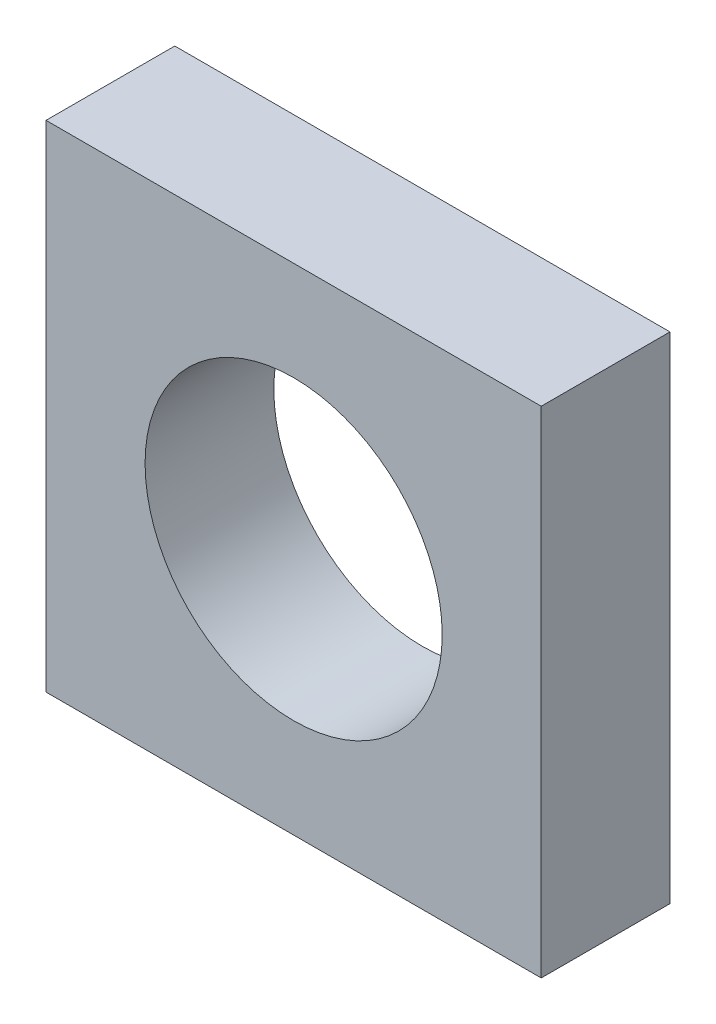
ISO-10303-21;
HEADER;
FILE_DESCRIPTION(('STEP AP214'),'2;1');
FILE_NAME('part.step','',(''),(''),'','','');
FILE_SCHEMA(('AUTOMOTIVE_DESIGN { 1 0 10303 214 1 1 1 1 }'));
ENDSEC;
DATA;
#1=APPLICATION_CONTEXT('core data for automotive mechanical design processes');
#2=APPLICATION_PROTOCOL_DEFINITION('international standard','automotive_design',2000,#1);
#3=PRODUCT_CONTEXT('',#1,'mechanical');
#4=PRODUCT('Part','Part','',(#3));
#5=PRODUCT_RELATED_PRODUCT_CATEGORY('part','',(#4));
#6=PRODUCT_DEFINITION_FORMATION('','',#4);
#7=PRODUCT_DEFINITION_CONTEXT('part definition',#1,'design');
#8=PRODUCT_DEFINITION('design','',#6,#7);
#9=PRODUCT_DEFINITION_SHAPE('','',#8);
#10=(LENGTH_UNIT() NAMED_UNIT(*) SI_UNIT(.MILLI.,.METRE.));
#11=(NAMED_UNIT(*) PLANE_ANGLE_UNIT() SI_UNIT($,.RADIAN.));
#12=(NAMED_UNIT(*) SI_UNIT($,.STERADIAN.) SOLID_ANGLE_UNIT());
#13=UNCERTAINTY_MEASURE_WITH_UNIT(LENGTH_MEASURE(1.E-05),#10,'distance_accuracy_value','');
#14=(GEOMETRIC_REPRESENTATION_CONTEXT(3) GLOBAL_UNCERTAINTY_ASSIGNED_CONTEXT((#13)) GLOBAL_UNIT_ASSIGNED_CONTEXT((#10,
#11,#12)) REPRESENTATION_CONTEXT('',''));
#15=CARTESIAN_POINT('',(0.,0.,0.));
#16=DIRECTION('',(0.,0.,1.));
#17=DIRECTION('',(1.,0.,0.));
#18=AXIS2_PLACEMENT_3D('',#15,#16,#17);
#19=CARTESIAN_POINT('',(0.,0.,13.));
#20=DIRECTION('',(0.,0.,1.));
#21=DIRECTION('',(1.,0.,0.));
#22=AXIS2_PLACEMENT_3D('',#19,#20,#21);
#23=PLANE('',#22);
#24=DIRECTION('',(0.,1.,0.));
#25=VECTOR('',#24,1.);
#26=CARTESIAN_POINT('',(25.,25.,13.));
#27=LINE('',#26,#25);
#28=CARTESIAN_POINT('',(25.,-25.,13.));
#29=VERTEX_POINT('',#28);
#30=CARTESIAN_POINT('',(25.,25.,13.));
#31=VERTEX_POINT('',#30);
#32=EDGE_CURVE('E99',#29,#31,#27,.T.);
#33=ORIENTED_EDGE('',*,*,#32,.T.);
#34=DIRECTION('',(-1.,0.,0.));
#35=VECTOR('',#34,1.);
#36=CARTESIAN_POINT('',(-25.,25.,13.));
#37=LINE('',#36,#35);
#38=CARTESIAN_POINT('',(-25.,25.,13.));
#39=VERTEX_POINT('',#38);
#40=EDGE_CURVE('E94',#31,#39,#37,.T.);
#41=ORIENTED_EDGE('',*,*,#40,.T.);
#42=DIRECTION('',(0.,-1.,0.));
#43=VECTOR('',#42,1.);
#44=CARTESIAN_POINT('',(-25.,25.,13.));
#45=LINE('',#44,#43);
#46=CARTESIAN_POINT('',(-25.,-25.,13.));
#47=VERTEX_POINT('',#46);
#48=EDGE_CURVE('E97',#39,#47,#45,.T.);
#49=ORIENTED_EDGE('',*,*,#48,.T.);
#50=DIRECTION('',(1.,0.,0.));
#51=VECTOR('',#50,1.);
#52=CARTESIAN_POINT('',(-25.,-25.,13.));
#53=LINE('',#52,#51);
#54=EDGE_CURVE('E64',#47,#29,#53,.T.);
#55=ORIENTED_EDGE('',*,*,#54,.T.);
#56=EDGE_LOOP('',(#33,#41,#49,#55));
#57=FACE_BOUND('',#56,.T.);
#58=CARTESIAN_POINT('',(0.,0.,13.));
#59=DIRECTION('',(0.,0.,1.));
#60=DIRECTION('',(1.,0.,0.));
#61=AXIS2_PLACEMENT_3D('',#58,#59,#60);
#62=CIRCLE('',#61,15.);
#63=CARTESIAN_POINT('',(15.,0.,13.));
#64=VERTEX_POINT('',#63);
#65=EDGE_CURVE('E114',#64,#64,#62,.T.);
#66=ORIENTED_EDGE('',*,*,#65,.F.);
#67=EDGE_LOOP('',(#66));
#68=FACE_BOUND('',#67,.T.);
#69=ADVANCED_FACE('F47',(#57,#68),#23,.T.);
#70=CARTESIAN_POINT('',(0.,0.,0.));
#71=DIRECTION('',(0.,0.,1.));
#72=DIRECTION('',(1.,0.,0.));
#73=AXIS2_PLACEMENT_3D('',#70,#71,#72);
#74=PLANE('',#73);
#75=DIRECTION('',(0.,1.,0.));
#76=VECTOR('',#75,1.);
#77=CARTESIAN_POINT('',(25.,25.,0.));
#78=LINE('',#77,#76);
#79=CARTESIAN_POINT('',(25.,-25.,0.));
#80=VERTEX_POINT('',#79);
#81=CARTESIAN_POINT('',(25.,25.,0.));
#82=VERTEX_POINT('',#81);
#83=EDGE_CURVE('E111',#80,#82,#78,.T.);
#84=ORIENTED_EDGE('',*,*,#83,.F.);
#85=DIRECTION('',(1.,0.,0.));
#86=VECTOR('',#85,1.);
#87=CARTESIAN_POINT('',(-25.,-25.,0.));
#88=LINE('',#87,#86);
#89=CARTESIAN_POINT('',(-25.,-25.,0.));
#90=VERTEX_POINT('',#89);
#91=EDGE_CURVE('E87',#90,#80,#88,.T.);
#92=ORIENTED_EDGE('',*,*,#91,.F.);
#93=DIRECTION('',(0.,-1.,0.));
#94=VECTOR('',#93,1.);
#95=CARTESIAN_POINT('',(-25.,25.,0.));
#96=LINE('',#95,#94);
#97=CARTESIAN_POINT('',(-25.,25.,0.));
#98=VERTEX_POINT('',#97);
#99=EDGE_CURVE('E81',#98,#90,#96,.T.);
#100=ORIENTED_EDGE('',*,*,#99,.F.);
#101=DIRECTION('',(-1.,0.,0.));
#102=VECTOR('',#101,1.);
#103=CARTESIAN_POINT('',(-25.,25.,0.));
#104=LINE('',#103,#102);
#105=EDGE_CURVE('E103',#82,#98,#104,.T.);
#106=ORIENTED_EDGE('',*,*,#105,.F.);
#107=EDGE_LOOP('',(#84,#92,#100,#106));
#108=FACE_BOUND('',#107,.T.);
#109=CARTESIAN_POINT('',(0.,0.,0.));
#110=DIRECTION('',(0.,0.,1.));
#111=DIRECTION('',(1.,0.,0.));
#112=AXIS2_PLACEMENT_3D('',#109,#110,#111);
#113=CIRCLE('',#112,15.);
#114=CARTESIAN_POINT('',(15.,0.,0.));
#115=VERTEX_POINT('',#114);
#116=EDGE_CURVE('E127',#115,#115,#113,.T.);
#117=ORIENTED_EDGE('',*,*,#116,.T.);
#118=EDGE_LOOP('',(#117));
#119=FACE_BOUND('',#118,.T.);
#120=ADVANCED_FACE('F123',(#108,#119),#74,.F.);
#121=CARTESIAN_POINT('',(25.,25.,13.));
#122=DIRECTION('',(-1.,0.,0.));
#123=DIRECTION('',(0.,-1.,0.));
#124=AXIS2_PLACEMENT_3D('',#121,#122,#123);
#125=PLANE('',#124);
#126=ORIENTED_EDGE('',*,*,#83,.T.);
#127=DIRECTION('',(0.,0.,-1.));
#128=VECTOR('',#127,1.);
#129=CARTESIAN_POINT('',(25.,25.,13.));
#130=LINE('',#129,#128);
#131=EDGE_CURVE('E12',#31,#82,#130,.T.);
#132=ORIENTED_EDGE('',*,*,#131,.F.);
#133=ORIENTED_EDGE('',*,*,#32,.F.);
#134=DIRECTION('',(0.,0.,-1.));
#135=VECTOR('',#134,1.);
#136=CARTESIAN_POINT('',(25.,-25.,13.));
#137=LINE('',#136,#135);
#138=EDGE_CURVE('E107',#29,#80,#137,.T.);
#139=ORIENTED_EDGE('',*,*,#138,.T.);
#140=EDGE_LOOP('',(#126,#132,#133,#139));
#141=FACE_BOUND('',#140,.T.);
#142=ADVANCED_FACE('F49',(#141),#125,.F.);
#143=CARTESIAN_POINT('',(-25.,25.,13.));
#144=DIRECTION('',(0.,-1.,0.));
#145=DIRECTION('',(0.,0.,-1.));
#146=AXIS2_PLACEMENT_3D('',#143,#144,#145);
#147=PLANE('',#146);
#148=ORIENTED_EDGE('',*,*,#105,.T.);
#149=DIRECTION('',(0.,0.,-1.));
#150=VECTOR('',#149,1.);
#151=CARTESIAN_POINT('',(-25.,25.,13.));
#152=LINE('',#151,#150);
#153=EDGE_CURVE('E56',#39,#98,#152,.T.);
#154=ORIENTED_EDGE('',*,*,#153,.F.);
#155=ORIENTED_EDGE('',*,*,#40,.F.);
#156=ORIENTED_EDGE('',*,*,#131,.T.);
#157=EDGE_LOOP('',(#148,#154,#155,#156));
#158=FACE_BOUND('',#157,.T.);
#159=ADVANCED_FACE('F102',(#158),#147,.F.);
#160=CARTESIAN_POINT('',(-25.,25.,13.));
#161=DIRECTION('',(1.,0.,0.));
#162=DIRECTION('',(0.,1.,0.));
#163=AXIS2_PLACEMENT_3D('',#160,#161,#162);
#164=PLANE('',#163);
#165=ORIENTED_EDGE('',*,*,#99,.T.);
#166=DIRECTION('',(0.,0.,-1.));
#167=VECTOR('',#166,1.);
#168=CARTESIAN_POINT('',(-25.,-25.,13.));
#169=LINE('',#168,#167);
#170=EDGE_CURVE('E104',#47,#90,#169,.T.);
#171=ORIENTED_EDGE('',*,*,#170,.F.);
#172=ORIENTED_EDGE('',*,*,#48,.F.);
#173=ORIENTED_EDGE('',*,*,#153,.T.);
#174=EDGE_LOOP('',(#165,#171,#172,#173));
#175=FACE_BOUND('',#174,.T.);
#176=ADVANCED_FACE('F105',(#175),#164,.F.);
#177=CARTESIAN_POINT('',(-25.,-25.,13.));
#178=DIRECTION('',(0.,1.,0.));
#179=DIRECTION('',(0.,0.,1.));
#180=AXIS2_PLACEMENT_3D('',#177,#178,#179);
#181=PLANE('',#180);
#182=ORIENTED_EDGE('',*,*,#91,.T.);
#183=ORIENTED_EDGE('',*,*,#138,.F.);
#184=ORIENTED_EDGE('',*,*,#54,.F.);
#185=ORIENTED_EDGE('',*,*,#170,.T.);
#186=EDGE_LOOP('',(#182,#183,#184,#185));
#187=FACE_BOUND('',#186,.T.);
#188=ADVANCED_FACE('F119',(#187),#181,.F.);
#189=CARTESIAN_POINT('',(0.,0.,13.));
#190=DIRECTION('',(0.,0.,-1.));
#191=DIRECTION('',(-1.,0.,0.));
#192=AXIS2_PLACEMENT_3D('',#189,#190,#191);
#193=CYLINDRICAL_SURFACE('',#192,15.);
#194=ORIENTED_EDGE('',*,*,#65,.T.);
#195=EDGE_LOOP('',(#194));
#196=FACE_BOUND('',#195,.T.);
#197=ORIENTED_EDGE('',*,*,#116,.F.);
#198=EDGE_LOOP('',(#197));
#199=FACE_BOUND('',#198,.T.);
#200=ADVANCED_FACE('F136',(#196,#199),#193,.F.);
#201=CLOSED_SHELL('',(#69,#120,#142,#159,#176,#188,#200));
#202=MANIFOLD_SOLID_BREP('B2',#201);
#203=ADVANCED_BREP_SHAPE_REPRESENTATION('',(#18,#202),#14);
#204=SHAPE_DEFINITION_REPRESENTATION(#9,#203);
ENDSEC;
END-ISO-10303-21;
